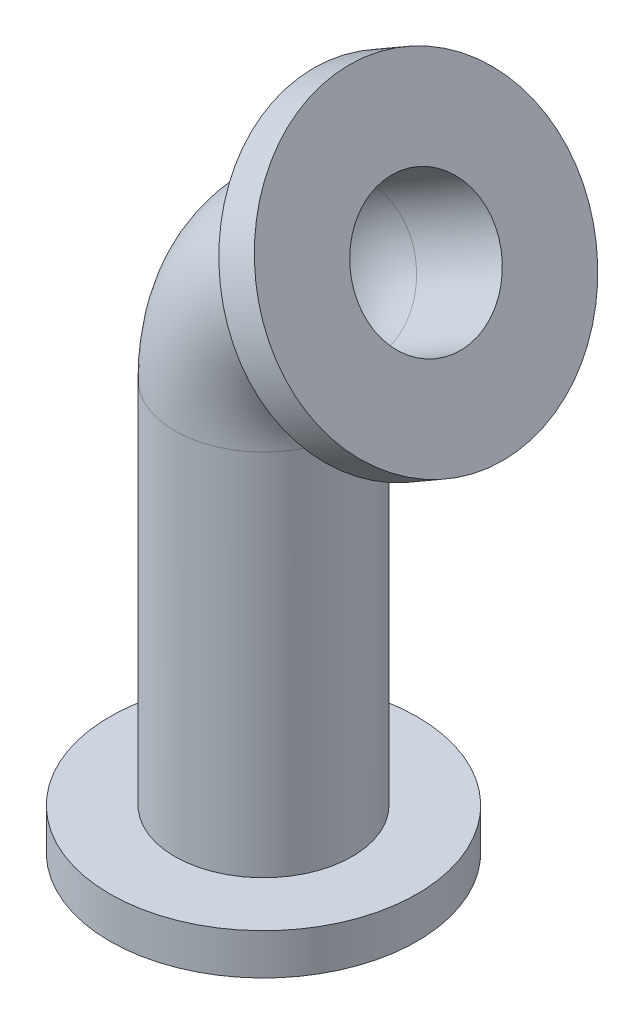
ISO-10303-21;
HEADER;
FILE_DESCRIPTION(('STEP AP214'),'2;1');
FILE_NAME('part.step','',(''),(''),'','','');
FILE_SCHEMA(('AUTOMOTIVE_DESIGN { 1 0 10303 214 1 1 1 1 }'));
ENDSEC;
DATA;
#1=APPLICATION_CONTEXT('core data for automotive mechanical design processes');
#2=APPLICATION_PROTOCOL_DEFINITION('international standard','automotive_design',2000,#1);
#3=PRODUCT_CONTEXT('',#1,'mechanical');
#4=PRODUCT('Part','Part','',(#3));
#5=PRODUCT_RELATED_PRODUCT_CATEGORY('part','',(#4));
#6=PRODUCT_DEFINITION_FORMATION('','',#4);
#7=PRODUCT_DEFINITION_CONTEXT('part definition',#1,'design');
#8=PRODUCT_DEFINITION('design','',#6,#7);
#9=PRODUCT_DEFINITION_SHAPE('','',#8);
#10=(LENGTH_UNIT() NAMED_UNIT(*) SI_UNIT(.MILLI.,.METRE.));
#11=(NAMED_UNIT(*) PLANE_ANGLE_UNIT() SI_UNIT($,.RADIAN.));
#12=(NAMED_UNIT(*) SI_UNIT($,.STERADIAN.) SOLID_ANGLE_UNIT());
#13=UNCERTAINTY_MEASURE_WITH_UNIT(LENGTH_MEASURE(1.E-05),#10,'distance_accuracy_value','');
#14=(GEOMETRIC_REPRESENTATION_CONTEXT(3) GLOBAL_UNCERTAINTY_ASSIGNED_CONTEXT((#13)) GLOBAL_UNIT_ASSIGNED_CONTEXT((#10,
#11,#12)) REPRESENTATION_CONTEXT('',''));
#15=CARTESIAN_POINT('',(0.,0.,0.));
#16=DIRECTION('',(0.,0.,1.));
#17=DIRECTION('',(1.,0.,0.));
#18=AXIS2_PLACEMENT_3D('',#15,#16,#17);
#19=CARTESIAN_POINT('',(22.5000000000001,158.9711431703,0.));
#20=DIRECTION('',(0.86602540378444,0.499999999999998,0.));
#21=DIRECTION('',(-0.499999999999998,0.86602540378444,0.));
#22=AXIS2_PLACEMENT_3D('',#19,#20,#21);
#23=CYLINDRICAL_SURFACE('',#22,45.);
#24=DIRECTION('',(0.86602540378444,0.499999999999998,0.));
#25=VECTOR('',#24,1.);
#26=CARTESIAN_POINT('',(45.,120.,0.));
#27=LINE('',#26,#25);
#28=CARTESIAN_POINT('',(59.7224318643355,128.5,0.));
#29=VERTEX_POINT('',#28);
#30=CARTESIAN_POINT('',(70.1147367097488,134.5,0.));
#31=VERTEX_POINT('',#30);
#32=EDGE_CURVE('E11',#29,#31,#27,.T.);
#33=ORIENTED_EDGE('',*,*,#32,.F.);
#34=CARTESIAN_POINT('',(37.2224318643356,167.4711431703,0.));
#35=DIRECTION('',(0.86602540378444,0.499999999999998,0.));
#36=DIRECTION('',(-0.499999999999998,0.86602540378444,0.));
#37=AXIS2_PLACEMENT_3D('',#34,#35,#36);
#38=CIRCLE('',#37,45.);
#39=EDGE_CURVE('E47',#29,#29,#38,.T.);
#40=ORIENTED_EDGE('',*,*,#39,.T.);
#41=ORIENTED_EDGE('',*,*,#32,.T.);
#42=CARTESIAN_POINT('',(47.6147367097488,173.4711431703,0.));
#43=DIRECTION('',(0.86602540378444,0.499999999999998,0.));
#44=DIRECTION('',(0.,0.,1.));
#45=AXIS2_PLACEMENT_3D('',#42,#43,#44);
#46=CIRCLE('',#45,45.);
#47=EDGE_CURVE('E42',#31,#31,#46,.T.);
#48=ORIENTED_EDGE('',*,*,#47,.F.);
#49=EDGE_LOOP('',(#33,#40,#41,#48));
#50=FACE_BOUND('',#49,.T.);
#51=ADVANCED_FACE('F35',(#50),#23,.T.);
#52=CARTESIAN_POINT('',(0.,120.,0.));
#53=DIRECTION('',(0.,-1.,0.));
#54=DIRECTION('',(0.,0.,-1.));
#55=AXIS2_PLACEMENT_3D('',#52,#53,#54);
#56=CYLINDRICAL_SURFACE('',#55,45.);
#57=CARTESIAN_POINT('',(0.,0.,0.));
#58=DIRECTION('',(0.,1.,0.));
#59=DIRECTION('',(0.,0.,1.));
#60=AXIS2_PLACEMENT_3D('',#57,#58,#59);
#61=CIRCLE('',#60,45.);
#62=CARTESIAN_POINT('',(0.,0.,45.));
#63=VERTEX_POINT('',#62);
#64=EDGE_CURVE('E56',#63,#63,#61,.T.);
#65=ORIENTED_EDGE('',*,*,#64,.T.);
#66=EDGE_LOOP('',(#65));
#67=FACE_BOUND('',#66,.T.);
#68=CARTESIAN_POINT('',(0.,12.,0.));
#69=DIRECTION('',(0.,1.,0.));
#70=DIRECTION('',(0.,0.,1.));
#71=AXIS2_PLACEMENT_3D('',#68,#69,#70);
#72=CIRCLE('',#71,45.);
#73=CARTESIAN_POINT('',(0.,12.,45.));
#74=VERTEX_POINT('',#73);
#75=EDGE_CURVE('E63',#74,#74,#72,.T.);
#76=ORIENTED_EDGE('',*,*,#75,.F.);
#77=EDGE_LOOP('',(#76));
#78=FACE_BOUND('',#77,.T.);
#79=ADVANCED_FACE('F95',(#67,#78),#56,.T.);
#80=CARTESIAN_POINT('',(22.5000000000001,158.9711431703,0.));
#81=DIRECTION('',(0.86602540378444,0.499999999999998,0.));
#82=DIRECTION('',(-0.499999999999998,0.86602540378444,0.));
#83=AXIS2_PLACEMENT_3D('',#80,#81,#82);
#84=CYLINDRICAL_SURFACE('',#83,20.);
#85=CARTESIAN_POINT('',(22.5000000000001,158.9711431703,0.));
#86=DIRECTION('',(0.86602540378444,0.499999999999998,0.));
#87=DIRECTION('',(0.,0.,1.));
#88=AXIS2_PLACEMENT_3D('',#85,#86,#87);
#89=CIRCLE('',#88,20.);
#90=CARTESIAN_POINT('',(12.5000000000001,176.291651245989,0.));
#91=VERTEX_POINT('',#90);
#92=EDGE_CURVE('E67',#91,#91,#89,.T.);
#93=ORIENTED_EDGE('',*,*,#92,.F.);
#94=EDGE_LOOP('',(#93));
#95=FACE_BOUND('',#94,.T.);
#96=CARTESIAN_POINT('',(47.6147367097488,173.4711431703,0.));
#97=DIRECTION('',(0.86602540378444,0.499999999999998,0.));
#98=DIRECTION('',(0.,0.,1.));
#99=AXIS2_PLACEMENT_3D('',#96,#97,#98);
#100=CIRCLE('',#99,20.);
#101=CARTESIAN_POINT('',(47.6147367097488,173.4711431703,20.));
#102=VERTEX_POINT('',#101);
#103=EDGE_CURVE('E73',#102,#102,#100,.T.);
#104=ORIENTED_EDGE('',*,*,#103,.T.);
#105=EDGE_LOOP('',(#104));
#106=FACE_BOUND('',#105,.T.);
#107=ADVANCED_FACE('F99',(#95,#106),#84,.F.);
#108=CARTESIAN_POINT('',(45.,120.,0.));
#109=DIRECTION('',(0.,0.,-1.));
#110=DIRECTION('',(-1.,0.,0.));
#111=AXIS2_PLACEMENT_3D('',#108,#109,#110);
#112=TOROIDAL_SURFACE('',#111,45.,20.);
#113=CARTESIAN_POINT('',(0.,120.,0.));
#114=DIRECTION('',(0.,1.,0.));
#115=DIRECTION('',(0.,0.,1.));
#116=AXIS2_PLACEMENT_3D('',#113,#114,#115);
#117=CIRCLE('',#116,20.);
#118=CARTESIAN_POINT('',(-20.,120.,0.));
#119=VERTEX_POINT('',#118);
#120=EDGE_CURVE('E65',#119,#119,#117,.T.);
#121=CARTESIAN_POINT('',(45.,120.,0.));
#122=DIRECTION('',(0.,0.,-1.));
#123=DIRECTION('',(-1.,0.,0.));
#124=AXIS2_PLACEMENT_3D('',#121,#122,#123);
#125=CIRCLE('',#124,65.);
#126=EDGE_CURVE('',#119,#91,#125,.T.);
#127=ORIENTED_EDGE('',*,*,#120,.F.);
#128=ORIENTED_EDGE('',*,*,#92,.T.);
#129=ORIENTED_EDGE('',*,*,#126,.T.);
#130=ORIENTED_EDGE('',*,*,#126,.F.);
#131=EDGE_LOOP('',(#127,#129,#128,#130));
#132=FACE_BOUND('',#131,.T.);
#133=ADVANCED_FACE('F89',(#132),#112,.F.);
#134=CARTESIAN_POINT('',(0.,120.,0.));
#135=DIRECTION('',(0.,-1.,0.));
#136=DIRECTION('',(0.,0.,-1.));
#137=AXIS2_PLACEMENT_3D('',#134,#135,#136);
#138=CYLINDRICAL_SURFACE('',#137,20.);
#139=ORIENTED_EDGE('',*,*,#120,.T.);
#140=EDGE_LOOP('',(#139));
#141=FACE_BOUND('',#140,.T.);
#142=CARTESIAN_POINT('',(0.,0.,0.));
#143=DIRECTION('',(0.,1.,0.));
#144=DIRECTION('',(0.,0.,1.));
#145=AXIS2_PLACEMENT_3D('',#142,#143,#144);
#146=CIRCLE('',#145,20.);
#147=CARTESIAN_POINT('',(0.,0.,20.));
#148=VERTEX_POINT('',#147);
#149=EDGE_CURVE('E52',#148,#148,#146,.T.);
#150=ORIENTED_EDGE('',*,*,#149,.F.);
#151=EDGE_LOOP('',(#150));
#152=FACE_BOUND('',#151,.T.);
#153=ADVANCED_FACE('F79',(#141,#152),#138,.F.);
#154=CARTESIAN_POINT('',(47.6147367097488,173.4711431703,0.));
#155=DIRECTION('',(0.86602540378444,0.499999999999998,0.));
#156=DIRECTION('',(0.,0.,1.));
#157=AXIS2_PLACEMENT_3D('',#154,#155,#156);
#158=PLANE('',#157);
#159=ORIENTED_EDGE('',*,*,#103,.F.);
#160=EDGE_LOOP('',(#159));
#161=FACE_BOUND('',#160,.T.);
#162=ORIENTED_EDGE('',*,*,#47,.T.);
#163=EDGE_LOOP('',(#162));
#164=FACE_BOUND('',#163,.T.);
#165=ADVANCED_FACE('F76',(#161,#164),#158,.T.);
#166=CARTESIAN_POINT('',(0.,0.,0.));
#167=DIRECTION('',(0.,1.,0.));
#168=DIRECTION('',(0.,0.,1.));
#169=AXIS2_PLACEMENT_3D('',#166,#167,#168);
#170=PLANE('',#169);
#171=ORIENTED_EDGE('',*,*,#149,.T.);
#172=EDGE_LOOP('',(#171));
#173=FACE_BOUND('',#172,.T.);
#174=ORIENTED_EDGE('',*,*,#64,.F.);
#175=EDGE_LOOP('',(#174));
#176=FACE_BOUND('',#175,.T.);
#177=ADVANCED_FACE('F78',(#173,#176),#170,.F.);
#178=CARTESIAN_POINT('',(22.5000000000001,158.9711431703,0.));
#179=DIRECTION('',(0.86602540378444,0.499999999999998,0.));
#180=DIRECTION('',(-0.499999999999998,0.86602540378444,0.));
#181=AXIS2_PLACEMENT_3D('',#178,#179,#180);
#182=CYLINDRICAL_SURFACE('',#181,26.);
#183=CARTESIAN_POINT('',(22.5000000000001,158.9711431703,0.));
#184=DIRECTION('',(-0.86602540378444,-0.499999999999998,0.));
#185=DIRECTION('',(0.499999999999998,-0.86602540378444,0.));
#186=AXIS2_PLACEMENT_3D('',#183,#184,#185);
#187=CIRCLE('',#186,26.);
#188=CARTESIAN_POINT('',(9.50000000000014,181.487803668695,0.));
#189=VERTEX_POINT('',#188);
#190=EDGE_CURVE('E59',#189,#189,#187,.F.);
#191=ORIENTED_EDGE('',*,*,#190,.T.);
#192=EDGE_LOOP('',(#191));
#193=FACE_BOUND('',#192,.T.);
#194=CARTESIAN_POINT('',(37.2224318643356,167.4711431703,0.));
#195=DIRECTION('',(0.86602540378444,0.499999999999998,0.));
#196=DIRECTION('',(-0.499999999999998,0.86602540378444,0.));
#197=AXIS2_PLACEMENT_3D('',#194,#195,#196);
#198=CIRCLE('',#197,26.);
#199=CARTESIAN_POINT('',(24.2224318643356,189.987803668695,0.));
#200=VERTEX_POINT('',#199);
#201=EDGE_CURVE('E53',#200,#200,#198,.T.);
#202=ORIENTED_EDGE('',*,*,#201,.F.);
#203=EDGE_LOOP('',(#202));
#204=FACE_BOUND('',#203,.T.);
#205=ADVANCED_FACE('F86',(#193,#204),#182,.T.);
#206=CARTESIAN_POINT('',(45.,120.,0.));
#207=DIRECTION('',(0.,0.,-1.));
#208=DIRECTION('',(-1.,0.,0.));
#209=AXIS2_PLACEMENT_3D('',#206,#207,#208);
#210=TOROIDAL_SURFACE('',#209,45.,26.);
#211=CARTESIAN_POINT('',(0.,120.,0.));
#212=DIRECTION('',(0.,-1.,0.));
#213=DIRECTION('',(0.,0.,-1.));
#214=AXIS2_PLACEMENT_3D('',#211,#212,#213);
#215=CIRCLE('',#214,26.);
#216=CARTESIAN_POINT('',(-26.,120.,0.));
#217=VERTEX_POINT('',#216);
#218=EDGE_CURVE('E202',#217,#217,#215,.F.);
#219=CARTESIAN_POINT('',(45.,120.,0.));
#220=DIRECTION('',(0.,0.,-1.));
#221=DIRECTION('',(-1.,0.,0.));
#222=AXIS2_PLACEMENT_3D('',#219,#220,#221);
#223=CIRCLE('',#222,71.);
#224=EDGE_CURVE('',#217,#189,#223,.T.);
#225=ORIENTED_EDGE('',*,*,#218,.T.);
#226=ORIENTED_EDGE('',*,*,#190,.F.);
#227=ORIENTED_EDGE('',*,*,#224,.T.);
#228=ORIENTED_EDGE('',*,*,#224,.F.);
#229=EDGE_LOOP('',(#225,#227,#226,#228));
#230=FACE_BOUND('',#229,.T.);
#231=ADVANCED_FACE('F153',(#230),#210,.T.);
#232=CARTESIAN_POINT('',(0.,120.,0.));
#233=DIRECTION('',(0.,-1.,0.));
#234=DIRECTION('',(0.,0.,-1.));
#235=AXIS2_PLACEMENT_3D('',#232,#233,#234);
#236=CYLINDRICAL_SURFACE('',#235,26.);
#237=ORIENTED_EDGE('',*,*,#218,.F.);
#238=EDGE_LOOP('',(#237));
#239=FACE_BOUND('',#238,.T.);
#240=CARTESIAN_POINT('',(0.,12.,0.));
#241=DIRECTION('',(0.,1.,0.));
#242=DIRECTION('',(0.,0.,1.));
#243=AXIS2_PLACEMENT_3D('',#240,#241,#242);
#244=CIRCLE('',#243,26.);
#245=CARTESIAN_POINT('',(0.,12.,26.));
#246=VERTEX_POINT('',#245);
#247=EDGE_CURVE('E199',#246,#246,#244,.T.);
#248=ORIENTED_EDGE('',*,*,#247,.T.);
#249=EDGE_LOOP('',(#248));
#250=FACE_BOUND('',#249,.T.);
#251=ADVANCED_FACE('F163',(#239,#250),#236,.T.);
#252=CARTESIAN_POINT('',(37.2224318643356,167.4711431703,0.));
#253=DIRECTION('',(0.86602540378444,0.499999999999998,0.));
#254=DIRECTION('',(0.,0.,1.));
#255=AXIS2_PLACEMENT_3D('',#252,#253,#254);
#256=PLANE('',#255);
#257=ORIENTED_EDGE('',*,*,#201,.T.);
#258=EDGE_LOOP('',(#257));
#259=FACE_BOUND('',#258,.T.);
#260=ORIENTED_EDGE('',*,*,#39,.F.);
#261=EDGE_LOOP('',(#260));
#262=FACE_BOUND('',#261,.T.);
#263=ADVANCED_FACE('F173',(#259,#262),#256,.F.);
#264=CARTESIAN_POINT('',(0.,12.,0.));
#265=DIRECTION('',(0.,1.,0.));
#266=DIRECTION('',(0.,0.,1.));
#267=AXIS2_PLACEMENT_3D('',#264,#265,#266);
#268=PLANE('',#267);
#269=ORIENTED_EDGE('',*,*,#247,.F.);
#270=EDGE_LOOP('',(#269));
#271=FACE_BOUND('',#270,.T.);
#272=ORIENTED_EDGE('',*,*,#75,.T.);
#273=EDGE_LOOP('',(#272));
#274=FACE_BOUND('',#273,.T.);
#275=ADVANCED_FACE('F183',(#271,#274),#268,.T.);
#276=CLOSED_SHELL('',(#51,#79,#107,#133,#153,#165,#177,#205,#231,#251,#263,#275));
#277=MANIFOLD_SOLID_BREP('B2',#276);
#278=ADVANCED_BREP_SHAPE_REPRESENTATION('',(#18,#277),#14);
#279=SHAPE_DEFINITION_REPRESENTATION(#9,#278);
ENDSEC;
END-ISO-10303-21;
